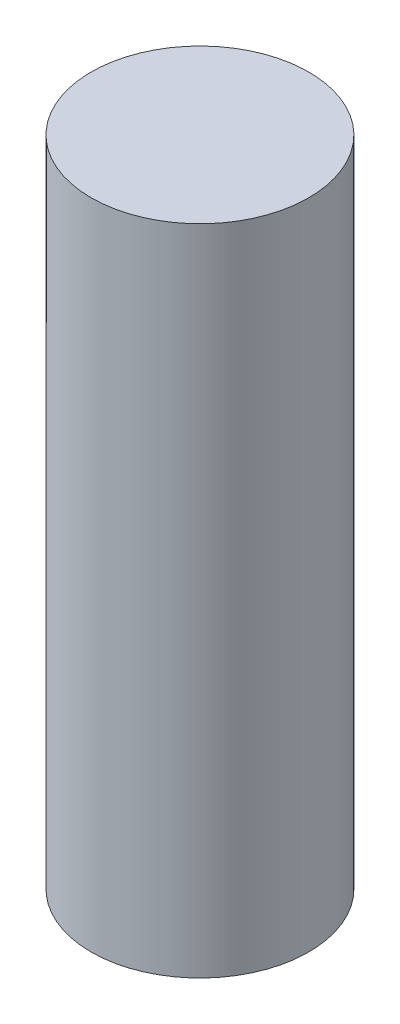
ISO-10303-21;
HEADER;
FILE_DESCRIPTION(('STEP AP214'),'2;1');
FILE_NAME('part.step','',(''),(''),'','','');
FILE_SCHEMA(('AUTOMOTIVE_DESIGN { 1 0 10303 214 1 1 1 1 }'));
ENDSEC;
DATA;
#1=APPLICATION_CONTEXT('core data for automotive mechanical design processes');
#2=APPLICATION_PROTOCOL_DEFINITION('international standard','automotive_design',2000,#1);
#3=PRODUCT_CONTEXT('',#1,'mechanical');
#4=PRODUCT('Part','Part','',(#3));
#5=PRODUCT_RELATED_PRODUCT_CATEGORY('part','',(#4));
#6=PRODUCT_DEFINITION_FORMATION('','',#4);
#7=PRODUCT_DEFINITION_CONTEXT('part definition',#1,'design');
#8=PRODUCT_DEFINITION('design','',#6,#7);
#9=PRODUCT_DEFINITION_SHAPE('','',#8);
#10=(LENGTH_UNIT() NAMED_UNIT(*) SI_UNIT(.MILLI.,.METRE.));
#11=(NAMED_UNIT(*) PLANE_ANGLE_UNIT() SI_UNIT($,.RADIAN.));
#12=(NAMED_UNIT(*) SI_UNIT($,.STERADIAN.) SOLID_ANGLE_UNIT());
#13=UNCERTAINTY_MEASURE_WITH_UNIT(LENGTH_MEASURE(1.E-05),#10,'distance_accuracy_value','');
#14=(GEOMETRIC_REPRESENTATION_CONTEXT(3) GLOBAL_UNCERTAINTY_ASSIGNED_CONTEXT((#13)) GLOBAL_UNIT_ASSIGNED_CONTEXT((#10,
#11,#12)) REPRESENTATION_CONTEXT('',''));
#15=CARTESIAN_POINT('',(0.,0.,0.));
#16=DIRECTION('',(0.,0.,1.));
#17=DIRECTION('',(1.,0.,0.));
#18=AXIS2_PLACEMENT_3D('',#15,#16,#17);
#19=CARTESIAN_POINT('',(0.,12.,0.));
#20=DIRECTION('',(0.,-1.,0.));
#21=DIRECTION('',(0.,0.,-1.));
#22=AXIS2_PLACEMENT_3D('',#19,#20,#21);
#23=CYLINDRICAL_SURFACE('',#22,2.);
#24=CARTESIAN_POINT('',(0.,12.,0.));
#25=DIRECTION('',(0.,1.,0.));
#26=DIRECTION('',(0.,0.,1.));
#27=AXIS2_PLACEMENT_3D('',#24,#25,#26);
#28=CIRCLE('',#27,2.);
#29=CARTESIAN_POINT('',(0.,12.,2.));
#30=VERTEX_POINT('',#29);
#31=EDGE_CURVE('E10',#30,#30,#28,.T.);
#32=ORIENTED_EDGE('',*,*,#31,.F.);
#33=EDGE_LOOP('',(#32));
#34=FACE_BOUND('',#33,.T.);
#35=CARTESIAN_POINT('',(0.,0.,0.));
#36=DIRECTION('',(0.,1.,0.));
#37=DIRECTION('',(0.,0.,1.));
#38=AXIS2_PLACEMENT_3D('',#35,#36,#37);
#39=CIRCLE('',#38,2.);
#40=CARTESIAN_POINT('',(0.,0.,2.));
#41=VERTEX_POINT('',#40);
#42=EDGE_CURVE('E34',#41,#41,#39,.T.);
#43=ORIENTED_EDGE('',*,*,#42,.T.);
#44=EDGE_LOOP('',(#43));
#45=FACE_BOUND('',#44,.T.);
#46=ADVANCED_FACE('F31',(#34,#45),#23,.T.);
#47=CARTESIAN_POINT('',(0.,12.,0.));
#48=DIRECTION('',(0.,1.,0.));
#49=DIRECTION('',(0.,0.,1.));
#50=AXIS2_PLACEMENT_3D('',#47,#48,#49);
#51=PLANE('',#50);
#52=ORIENTED_EDGE('',*,*,#31,.T.);
#53=EDGE_LOOP('',(#52));
#54=FACE_BOUND('',#53,.T.);
#55=ADVANCED_FACE('F46',(#54),#51,.T.);
#56=CARTESIAN_POINT('',(0.,0.,0.));
#57=DIRECTION('',(0.,1.,0.));
#58=DIRECTION('',(0.,0.,1.));
#59=AXIS2_PLACEMENT_3D('',#56,#57,#58);
#60=PLANE('',#59);
#61=ORIENTED_EDGE('',*,*,#42,.F.);
#62=EDGE_LOOP('',(#61));
#63=FACE_BOUND('',#62,.T.);
#64=ADVANCED_FACE('F44',(#63),#60,.F.);
#65=CLOSED_SHELL('',(#46,#55,#64));
#66=MANIFOLD_SOLID_BREP('B2',#65);
#67=ADVANCED_BREP_SHAPE_REPRESENTATION('',(#18,#66),#14);
#68=SHAPE_DEFINITION_REPRESENTATION(#9,#67);
ENDSEC;
END-ISO-10303-21;
